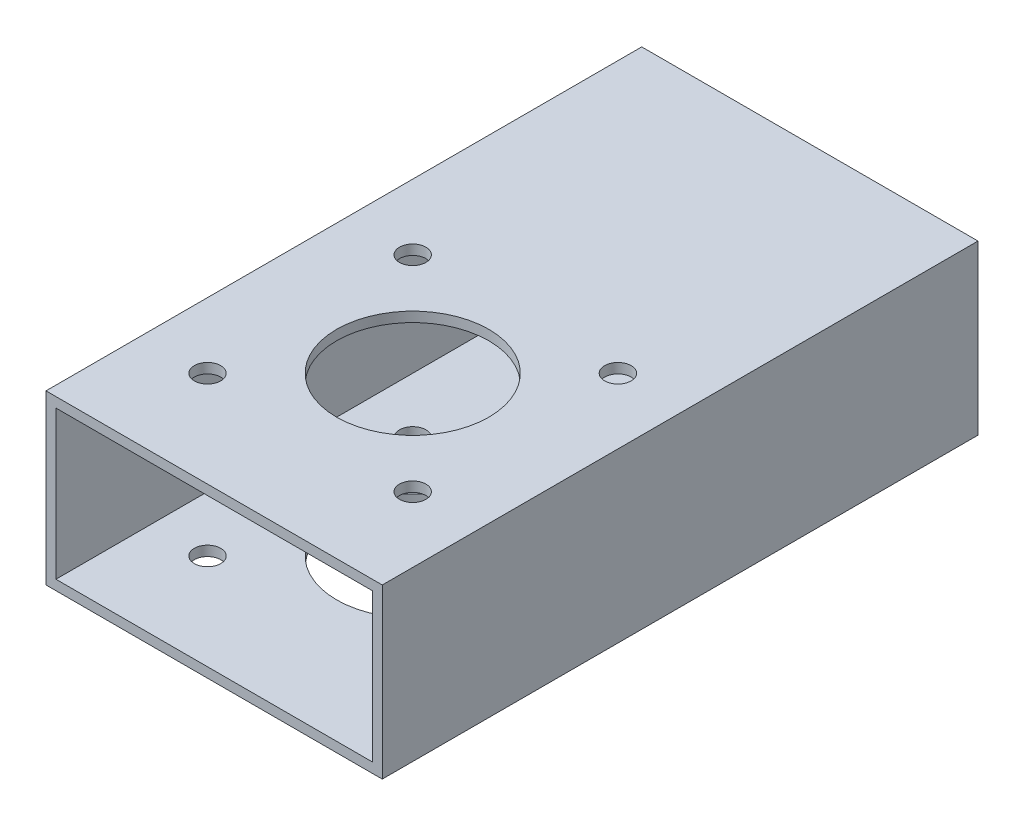
ISO-10303-21;
HEADER;
FILE_DESCRIPTION(('STEP AP214'),'2;1');
FILE_NAME('part.step','',(''),(''),'','','');
FILE_SCHEMA(('AUTOMOTIVE_DESIGN { 1 0 10303 214 1 1 1 1 }'));
ENDSEC;
DATA;
#1=APPLICATION_CONTEXT('core data for automotive mechanical design processes');
#2=APPLICATION_PROTOCOL_DEFINITION('international standard','automotive_design',2000,#1);
#3=PRODUCT_CONTEXT('',#1,'mechanical');
#4=PRODUCT('Part','Part','',(#3));
#5=PRODUCT_RELATED_PRODUCT_CATEGORY('part','',(#4));
#6=PRODUCT_DEFINITION_FORMATION('','',#4);
#7=PRODUCT_DEFINITION_CONTEXT('part definition',#1,'design');
#8=PRODUCT_DEFINITION('design','',#6,#7);
#9=PRODUCT_DEFINITION_SHAPE('','',#8);
#10=(LENGTH_UNIT() NAMED_UNIT(*) SI_UNIT(.MILLI.,.METRE.));
#11=(NAMED_UNIT(*) PLANE_ANGLE_UNIT() SI_UNIT($,.RADIAN.));
#12=(NAMED_UNIT(*) SI_UNIT($,.STERADIAN.) SOLID_ANGLE_UNIT());
#13=UNCERTAINTY_MEASURE_WITH_UNIT(LENGTH_MEASURE(1.E-05),#10,'distance_accuracy_value','');
#14=(GEOMETRIC_REPRESENTATION_CONTEXT(3) GLOBAL_UNCERTAINTY_ASSIGNED_CONTEXT((#13)) GLOBAL_UNIT_ASSIGNED_CONTEXT((#10,
#11,#12)) REPRESENTATION_CONTEXT('',''));
#15=CARTESIAN_POINT('',(0.,0.,0.));
#16=DIRECTION('',(0.,0.,1.));
#17=DIRECTION('',(1.,0.,0.));
#18=AXIS2_PLACEMENT_3D('',#15,#16,#17);
#19=CARTESIAN_POINT('',(0.,0.,90.));
#20=DIRECTION('',(0.,0.,-1.));
#21=DIRECTION('',(-1.,0.,0.));
#22=AXIS2_PLACEMENT_3D('',#19,#20,#21);
#23=PLANE('',#22);
#24=DIRECTION('',(0.,1.,0.));
#25=VECTOR('',#24,1.);
#26=CARTESIAN_POINT('',(25.3999999999999,-12.7,90.));
#27=LINE('',#26,#25);
#28=CARTESIAN_POINT('',(25.3999999999999,-12.7,90.));
#29=VERTEX_POINT('',#28);
#30=CARTESIAN_POINT('',(25.4,12.7,90.));
#31=VERTEX_POINT('',#30);
#32=EDGE_CURVE('E141',#29,#31,#27,.T.);
#33=ORIENTED_EDGE('',*,*,#32,.T.);
#34=DIRECTION('',(-1.,0.,0.));
#35=VECTOR('',#34,1.);
#36=CARTESIAN_POINT('',(-25.4,12.6999999999999,90.));
#37=LINE('',#36,#35);
#38=CARTESIAN_POINT('',(-25.4,12.6999999999999,90.));
#39=VERTEX_POINT('',#38);
#40=EDGE_CURVE('E144',#31,#39,#37,.T.);
#41=ORIENTED_EDGE('',*,*,#40,.T.);
#42=DIRECTION('',(0.,-1.,0.));
#43=VECTOR('',#42,1.);
#44=CARTESIAN_POINT('',(-25.4000000000001,-12.7000000000002,90.));
#45=LINE('',#44,#43);
#46=CARTESIAN_POINT('',(-25.4000000000001,-12.7000000000002,90.));
#47=VERTEX_POINT('',#46);
#48=EDGE_CURVE('E147',#39,#47,#45,.T.);
#49=ORIENTED_EDGE('',*,*,#48,.T.);
#50=DIRECTION('',(1.,0.,0.));
#51=VECTOR('',#50,1.);
#52=CARTESIAN_POINT('',(-25.4000000000001,-12.7000000000002,90.));
#53=LINE('',#52,#51);
#54=EDGE_CURVE('E149',#47,#29,#53,.T.);
#55=ORIENTED_EDGE('',*,*,#54,.T.);
#56=EDGE_LOOP('',(#33,#41,#49,#55));
#57=FACE_BOUND('',#56,.T.);
#58=DIRECTION('',(0.,-1.,0.));
#59=VECTOR('',#58,1.);
#60=CARTESIAN_POINT('',(-23.9000000000001,-11.2,90.));
#61=LINE('',#60,#59);
#62=CARTESIAN_POINT('',(-23.9,11.2,90.));
#63=VERTEX_POINT('',#62);
#64=CARTESIAN_POINT('',(-23.9000000000001,-11.2,90.));
#65=VERTEX_POINT('',#64);
#66=EDGE_CURVE('E103',#63,#65,#61,.T.);
#67=ORIENTED_EDGE('',*,*,#66,.F.);
#68=DIRECTION('',(-1.,0.,0.));
#69=VECTOR('',#68,1.);
#70=CARTESIAN_POINT('',(-23.9,11.2,90.));
#71=LINE('',#70,#69);
#72=CARTESIAN_POINT('',(23.9,11.2,90.));
#73=VERTEX_POINT('',#72);
#74=EDGE_CURVE('E125',#73,#63,#71,.T.);
#75=ORIENTED_EDGE('',*,*,#74,.F.);
#76=DIRECTION('',(0.,1.,0.));
#77=VECTOR('',#76,1.);
#78=CARTESIAN_POINT('',(23.8999999999999,-11.2,90.));
#79=LINE('',#78,#77);
#80=CARTESIAN_POINT('',(23.8999999999999,-11.2,90.));
#81=VERTEX_POINT('',#80);
#82=EDGE_CURVE('E123',#81,#73,#79,.T.);
#83=ORIENTED_EDGE('',*,*,#82,.F.);
#84=DIRECTION('',(1.,0.,0.));
#85=VECTOR('',#84,1.);
#86=CARTESIAN_POINT('',(-23.9000000000001,-11.2,90.));
#87=LINE('',#86,#85);
#88=EDGE_CURVE('E111',#65,#81,#87,.T.);
#89=ORIENTED_EDGE('',*,*,#88,.F.);
#90=EDGE_LOOP('',(#67,#75,#83,#89));
#91=FACE_BOUND('',#90,.T.);
#92=ADVANCED_FACE('F36',(#57,#91),#23,.F.);
#93=CARTESIAN_POINT('',(0.,0.,0.));
#94=DIRECTION('',(0.,0.,-1.));
#95=DIRECTION('',(-1.,0.,0.));
#96=AXIS2_PLACEMENT_3D('',#93,#94,#95);
#97=PLANE('',#96);
#98=DIRECTION('',(0.,1.,0.));
#99=VECTOR('',#98,1.);
#100=CARTESIAN_POINT('',(25.3999999999999,-12.7000000000002,0.));
#101=LINE('',#100,#99);
#102=CARTESIAN_POINT('',(25.3999999999999,-12.7000000000002,0.));
#103=VERTEX_POINT('',#102);
#104=CARTESIAN_POINT('',(25.4,12.6999999999998,0.));
#105=VERTEX_POINT('',#104);
#106=EDGE_CURVE('E119',#103,#105,#101,.T.);
#107=ORIENTED_EDGE('',*,*,#106,.F.);
#108=DIRECTION('',(1.,0.,0.));
#109=VECTOR('',#108,1.);
#110=CARTESIAN_POINT('',(-25.4000000000001,-12.7,0.));
#111=LINE('',#110,#109);
#112=CARTESIAN_POINT('',(-25.4000000000001,-12.7,0.));
#113=VERTEX_POINT('',#112);
#114=EDGE_CURVE('E145',#113,#103,#111,.T.);
#115=ORIENTED_EDGE('',*,*,#114,.F.);
#116=DIRECTION('',(0.,-1.,0.));
#117=VECTOR('',#116,1.);
#118=CARTESIAN_POINT('',(-25.4000000000001,-12.7,0.));
#119=LINE('',#118,#117);
#120=CARTESIAN_POINT('',(-25.4,12.7,0.));
#121=VERTEX_POINT('',#120);
#122=EDGE_CURVE('E156',#121,#113,#119,.T.);
#123=ORIENTED_EDGE('',*,*,#122,.F.);
#124=DIRECTION('',(-1.,0.,0.));
#125=VECTOR('',#124,1.);
#126=CARTESIAN_POINT('',(-25.4,12.7,0.));
#127=LINE('',#126,#125);
#128=EDGE_CURVE('E154',#105,#121,#127,.T.);
#129=ORIENTED_EDGE('',*,*,#128,.F.);
#130=EDGE_LOOP('',(#107,#115,#123,#129));
#131=FACE_BOUND('',#130,.T.);
#132=DIRECTION('',(-1.,0.,0.));
#133=VECTOR('',#132,1.);
#134=CARTESIAN_POINT('',(-23.9,11.2,0.));
#135=LINE('',#134,#133);
#136=CARTESIAN_POINT('',(23.9,11.1999999999998,0.));
#137=VERTEX_POINT('',#136);
#138=CARTESIAN_POINT('',(-23.9,11.2,0.));
#139=VERTEX_POINT('',#138);
#140=EDGE_CURVE('E112',#137,#139,#135,.T.);
#141=ORIENTED_EDGE('',*,*,#140,.T.);
#142=DIRECTION('',(0.,-1.,0.));
#143=VECTOR('',#142,1.);
#144=CARTESIAN_POINT('',(-23.9000000000001,-11.2,0.));
#145=LINE('',#144,#143);
#146=CARTESIAN_POINT('',(-23.9000000000001,-11.2,0.));
#147=VERTEX_POINT('',#146);
#148=EDGE_CURVE('E61',#139,#147,#145,.T.);
#149=ORIENTED_EDGE('',*,*,#148,.T.);
#150=DIRECTION('',(1.,0.,0.));
#151=VECTOR('',#150,1.);
#152=CARTESIAN_POINT('',(-23.9000000000001,-11.2,0.));
#153=LINE('',#152,#151);
#154=CARTESIAN_POINT('',(23.8999999999999,-11.2000000000002,0.));
#155=VERTEX_POINT('',#154);
#156=EDGE_CURVE('E118',#147,#155,#153,.T.);
#157=ORIENTED_EDGE('',*,*,#156,.T.);
#158=DIRECTION('',(0.,1.,0.));
#159=VECTOR('',#158,1.);
#160=CARTESIAN_POINT('',(23.8999999999999,-11.2000000000002,0.));
#161=LINE('',#160,#159);
#162=EDGE_CURVE('E133',#155,#137,#161,.T.);
#163=ORIENTED_EDGE('',*,*,#162,.T.);
#164=EDGE_LOOP('',(#141,#149,#157,#163));
#165=FACE_BOUND('',#164,.T.);
#166=ADVANCED_FACE('F241',(#131,#165),#97,.T.);
#167=CARTESIAN_POINT('',(25.3999999999999,-12.7,90.));
#168=DIRECTION('',(-1.,0.,0.));
#169=DIRECTION('',(0.,0.,1.));
#170=AXIS2_PLACEMENT_3D('',#167,#168,#169);
#171=PLANE('',#170);
#172=ORIENTED_EDGE('',*,*,#106,.T.);
#173=DIRECTION('',(0.,0.,-1.));
#174=VECTOR('',#173,1.);
#175=CARTESIAN_POINT('',(25.4,12.7,90.));
#176=LINE('',#175,#174);
#177=EDGE_CURVE('E11',#31,#105,#176,.T.);
#178=ORIENTED_EDGE('',*,*,#177,.F.);
#179=ORIENTED_EDGE('',*,*,#32,.F.);
#180=DIRECTION('',(0.,0.,-1.));
#181=VECTOR('',#180,1.);
#182=CARTESIAN_POINT('',(25.3999999999999,-12.7,90.));
#183=LINE('',#182,#181);
#184=EDGE_CURVE('E151',#29,#103,#183,.T.);
#185=ORIENTED_EDGE('',*,*,#184,.T.);
#186=EDGE_LOOP('',(#172,#178,#179,#185));
#187=FACE_BOUND('',#186,.T.);
#188=ADVANCED_FACE('F38',(#187),#171,.F.);
#189=CARTESIAN_POINT('',(-25.4,12.6999999999999,90.));
#190=DIRECTION('',(0.,-1.,0.));
#191=DIRECTION('',(0.,0.,-1.));
#192=AXIS2_PLACEMENT_3D('',#189,#190,#191);
#193=PLANE('',#192);
#194=CARTESIAN_POINT('',(-15.5,12.7,44.5));
#195=DIRECTION('',(0.,-1.,0.));
#196=DIRECTION('',(0.,0.,-1.));
#197=AXIS2_PLACEMENT_3D('',#194,#195,#196);
#198=CIRCLE('',#197,2.);
#199=CARTESIAN_POINT('',(-15.5,12.7,42.5));
#200=VERTEX_POINT('',#199);
#201=EDGE_CURVE('E190',#200,#200,#198,.T.);
#202=ORIENTED_EDGE('',*,*,#201,.T.);
#203=EDGE_LOOP('',(#202));
#204=FACE_BOUND('',#203,.T.);
#205=CARTESIAN_POINT('',(15.5,12.7,44.5));
#206=DIRECTION('',(0.,-1.,0.));
#207=DIRECTION('',(0.,0.,-1.));
#208=AXIS2_PLACEMENT_3D('',#205,#206,#207);
#209=CIRCLE('',#208,2.);
#210=CARTESIAN_POINT('',(15.5,12.7,42.5));
#211=VERTEX_POINT('',#210);
#212=EDGE_CURVE('E187',#211,#211,#209,.T.);
#213=ORIENTED_EDGE('',*,*,#212,.T.);
#214=EDGE_LOOP('',(#213));
#215=FACE_BOUND('',#214,.T.);
#216=CARTESIAN_POINT('',(15.5,12.6999999999998,75.5));
#217=DIRECTION('',(0.,-1.,0.));
#218=DIRECTION('',(0.,0.,-1.));
#219=AXIS2_PLACEMENT_3D('',#216,#217,#218);
#220=CIRCLE('',#219,2.);
#221=CARTESIAN_POINT('',(15.5,12.6999999999998,73.5));
#222=VERTEX_POINT('',#221);
#223=EDGE_CURVE('E205',#222,#222,#220,.T.);
#224=ORIENTED_EDGE('',*,*,#223,.T.);
#225=EDGE_LOOP('',(#224));
#226=FACE_BOUND('',#225,.T.);
#227=CARTESIAN_POINT('',(-15.5,12.7,75.5));
#228=DIRECTION('',(0.,-1.,0.));
#229=DIRECTION('',(0.,0.,-1.));
#230=AXIS2_PLACEMENT_3D('',#227,#228,#229);
#231=CIRCLE('',#230,2.);
#232=CARTESIAN_POINT('',(-15.5,12.7,73.5));
#233=VERTEX_POINT('',#232);
#234=EDGE_CURVE('E212',#233,#233,#231,.T.);
#235=ORIENTED_EDGE('',*,*,#234,.T.);
#236=EDGE_LOOP('',(#235));
#237=FACE_BOUND('',#236,.T.);
#238=CARTESIAN_POINT('',(0.,12.6999999999999,60.));
#239=DIRECTION('',(0.,-1.,0.));
#240=DIRECTION('',(0.,0.,-1.));
#241=AXIS2_PLACEMENT_3D('',#238,#239,#240);
#242=CIRCLE('',#241,11.5);
#243=CARTESIAN_POINT('',(0.,12.6999999999999,48.5));
#244=VERTEX_POINT('',#243);
#245=EDGE_CURVE('E131',#244,#244,#242,.T.);
#246=ORIENTED_EDGE('',*,*,#245,.T.);
#247=EDGE_LOOP('',(#246));
#248=FACE_BOUND('',#247,.T.);
#249=ORIENTED_EDGE('',*,*,#128,.T.);
#250=DIRECTION('',(0.,0.,-1.));
#251=VECTOR('',#250,1.);
#252=CARTESIAN_POINT('',(-25.4,12.6999999999999,90.));
#253=LINE('',#252,#251);
#254=EDGE_CURVE('E45',#39,#121,#253,.T.);
#255=ORIENTED_EDGE('',*,*,#254,.F.);
#256=ORIENTED_EDGE('',*,*,#40,.F.);
#257=ORIENTED_EDGE('',*,*,#177,.T.);
#258=EDGE_LOOP('',(#249,#255,#256,#257));
#259=FACE_BOUND('',#258,.T.);
#260=ADVANCED_FACE('F221',(#204,#215,#226,#237,#248,#259),#193,.F.);
#261=CARTESIAN_POINT('',(-25.4000000000001,-12.7000000000002,90.));
#262=DIRECTION('',(1.,0.,0.));
#263=DIRECTION('',(0.,0.,-1.));
#264=AXIS2_PLACEMENT_3D('',#261,#262,#263);
#265=PLANE('',#264);
#266=ORIENTED_EDGE('',*,*,#122,.T.);
#267=DIRECTION('',(0.,0.,-1.));
#268=VECTOR('',#267,1.);
#269=CARTESIAN_POINT('',(-25.4000000000001,-12.7000000000002,90.));
#270=LINE('',#269,#268);
#271=EDGE_CURVE('E161',#47,#113,#270,.T.);
#272=ORIENTED_EDGE('',*,*,#271,.F.);
#273=ORIENTED_EDGE('',*,*,#48,.F.);
#274=ORIENTED_EDGE('',*,*,#254,.T.);
#275=EDGE_LOOP('',(#266,#272,#273,#274));
#276=FACE_BOUND('',#275,.T.);
#277=ADVANCED_FACE('F255',(#276),#265,.F.);
#278=CARTESIAN_POINT('',(-25.4000000000001,-12.7000000000002,90.));
#279=DIRECTION('',(0.,1.,0.));
#280=DIRECTION('',(0.,0.,1.));
#281=AXIS2_PLACEMENT_3D('',#278,#279,#280);
#282=PLANE('',#281);
#283=CARTESIAN_POINT('',(-15.5000000000001,-12.7,44.5));
#284=DIRECTION('',(0.,-1.,0.));
#285=DIRECTION('',(0.,0.,1.));
#286=AXIS2_PLACEMENT_3D('',#283,#284,#285);
#287=CIRCLE('',#286,2.);
#288=CARTESIAN_POINT('',(-15.5000000000001,-12.7,46.5));
#289=VERTEX_POINT('',#288);
#290=EDGE_CURVE('E303',#289,#289,#287,.T.);
#291=ORIENTED_EDGE('',*,*,#290,.F.);
#292=EDGE_LOOP('',(#291));
#293=FACE_BOUND('',#292,.T.);
#294=CARTESIAN_POINT('',(15.4999999999999,-12.7,44.5));
#295=DIRECTION('',(0.,-1.,0.));
#296=DIRECTION('',(0.,0.,-1.));
#297=AXIS2_PLACEMENT_3D('',#294,#295,#296);
#298=CIRCLE('',#297,2.);
#299=CARTESIAN_POINT('',(15.4999999999999,-12.7,42.5));
#300=VERTEX_POINT('',#299);
#301=EDGE_CURVE('E183',#300,#300,#298,.T.);
#302=ORIENTED_EDGE('',*,*,#301,.F.);
#303=EDGE_LOOP('',(#302));
#304=FACE_BOUND('',#303,.T.);
#305=CARTESIAN_POINT('',(15.4999999999999,-12.7000000000002,75.5));
#306=DIRECTION('',(0.,-1.,0.));
#307=DIRECTION('',(0.,0.,1.));
#308=AXIS2_PLACEMENT_3D('',#305,#306,#307);
#309=CIRCLE('',#308,2.);
#310=CARTESIAN_POINT('',(15.4999999999999,-12.7000000000002,77.5));
#311=VERTEX_POINT('',#310);
#312=EDGE_CURVE('E179',#311,#311,#309,.T.);
#313=ORIENTED_EDGE('',*,*,#312,.F.);
#314=EDGE_LOOP('',(#313));
#315=FACE_BOUND('',#314,.T.);
#316=CARTESIAN_POINT('',(-15.5000000000001,-12.7,75.5));
#317=DIRECTION('',(0.,-1.,0.));
#318=DIRECTION('',(0.,0.,-1.));
#319=AXIS2_PLACEMENT_3D('',#316,#317,#318);
#320=CIRCLE('',#319,2.);
#321=CARTESIAN_POINT('',(-15.5000000000001,-12.7,73.5));
#322=VERTEX_POINT('',#321);
#323=EDGE_CURVE('E175',#322,#322,#320,.T.);
#324=ORIENTED_EDGE('',*,*,#323,.F.);
#325=EDGE_LOOP('',(#324));
#326=FACE_BOUND('',#325,.T.);
#327=CARTESIAN_POINT('',(-1.11022302462516E-13,-12.7000000000002,60.));
#328=DIRECTION('',(0.,-1.,0.));
#329=DIRECTION('',(0.,0.,-1.));
#330=AXIS2_PLACEMENT_3D('',#327,#328,#329);
#331=CIRCLE('',#330,11.5);
#332=CARTESIAN_POINT('',(-1.11022302462511E-13,-12.7000000000002,48.5));
#333=VERTEX_POINT('',#332);
#334=EDGE_CURVE('E170',#333,#333,#331,.T.);
#335=ORIENTED_EDGE('',*,*,#334,.F.);
#336=EDGE_LOOP('',(#335));
#337=FACE_BOUND('',#336,.T.);
#338=ORIENTED_EDGE('',*,*,#114,.T.);
#339=ORIENTED_EDGE('',*,*,#184,.F.);
#340=ORIENTED_EDGE('',*,*,#54,.F.);
#341=ORIENTED_EDGE('',*,*,#271,.T.);
#342=EDGE_LOOP('',(#338,#339,#340,#341));
#343=FACE_BOUND('',#342,.T.);
#344=ADVANCED_FACE('F252',(#293,#304,#315,#326,#337,#343),#282,.F.);
#345=CARTESIAN_POINT('',(-23.9000000000001,-11.2,90.));
#346=DIRECTION('',(1.,0.,0.));
#347=DIRECTION('',(0.,0.,-1.));
#348=AXIS2_PLACEMENT_3D('',#345,#346,#347);
#349=PLANE('',#348);
#350=ORIENTED_EDGE('',*,*,#148,.F.);
#351=DIRECTION('',(0.,0.,-1.));
#352=VECTOR('',#351,1.);
#353=CARTESIAN_POINT('',(-23.9,11.2,90.));
#354=LINE('',#353,#352);
#355=EDGE_CURVE('E107',#63,#139,#354,.T.);
#356=ORIENTED_EDGE('',*,*,#355,.F.);
#357=ORIENTED_EDGE('',*,*,#66,.T.);
#358=DIRECTION('',(0.,0.,-1.));
#359=VECTOR('',#358,1.);
#360=CARTESIAN_POINT('',(-23.9000000000001,-11.2,90.));
#361=LINE('',#360,#359);
#362=EDGE_CURVE('E106',#65,#147,#361,.T.);
#363=ORIENTED_EDGE('',*,*,#362,.T.);
#364=EDGE_LOOP('',(#350,#356,#357,#363));
#365=FACE_BOUND('',#364,.T.);
#366=ADVANCED_FACE('F105',(#365),#349,.T.);
#367=CARTESIAN_POINT('',(-23.9000000000001,-11.2,90.));
#368=DIRECTION('',(0.,1.,0.));
#369=DIRECTION('',(0.,0.,1.));
#370=AXIS2_PLACEMENT_3D('',#367,#368,#369);
#371=PLANE('',#370);
#372=CARTESIAN_POINT('',(-15.5000000000001,-11.2,44.5));
#373=DIRECTION('',(0.,1.,0.));
#374=DIRECTION('',(0.,0.,1.));
#375=AXIS2_PLACEMENT_3D('',#372,#373,#374);
#376=CIRCLE('',#375,2.);
#377=CARTESIAN_POINT('',(-15.5000000000001,-11.2,46.5));
#378=VERTEX_POINT('',#377);
#379=EDGE_CURVE('E195',#378,#378,#376,.T.);
#380=ORIENTED_EDGE('',*,*,#379,.F.);
#381=EDGE_LOOP('',(#380));
#382=FACE_BOUND('',#381,.T.);
#383=CARTESIAN_POINT('',(15.4999999999999,-11.2,44.5));
#384=DIRECTION('',(0.,1.,0.));
#385=DIRECTION('',(0.,0.,1.));
#386=AXIS2_PLACEMENT_3D('',#383,#384,#385);
#387=CIRCLE('',#386,2.);
#388=CARTESIAN_POINT('',(15.4999999999999,-11.2,46.5));
#389=VERTEX_POINT('',#388);
#390=EDGE_CURVE('E182',#389,#389,#387,.T.);
#391=ORIENTED_EDGE('',*,*,#390,.F.);
#392=EDGE_LOOP('',(#391));
#393=FACE_BOUND('',#392,.T.);
#394=CARTESIAN_POINT('',(15.4999999999999,-11.2000000000002,75.5));
#395=DIRECTION('',(0.,1.,0.));
#396=DIRECTION('',(0.,0.,1.));
#397=AXIS2_PLACEMENT_3D('',#394,#395,#396);
#398=CIRCLE('',#397,2.);
#399=CARTESIAN_POINT('',(15.4999999999999,-11.2000000000002,77.5));
#400=VERTEX_POINT('',#399);
#401=EDGE_CURVE('E178',#400,#400,#398,.T.);
#402=ORIENTED_EDGE('',*,*,#401,.F.);
#403=EDGE_LOOP('',(#402));
#404=FACE_BOUND('',#403,.T.);
#405=CARTESIAN_POINT('',(-15.5000000000001,-11.2,75.5));
#406=DIRECTION('',(0.,1.,0.));
#407=DIRECTION('',(0.,0.,1.));
#408=AXIS2_PLACEMENT_3D('',#405,#406,#407);
#409=CIRCLE('',#408,2.);
#410=CARTESIAN_POINT('',(-15.5000000000001,-11.2,77.5));
#411=VERTEX_POINT('',#410);
#412=EDGE_CURVE('E174',#411,#411,#409,.T.);
#413=ORIENTED_EDGE('',*,*,#412,.F.);
#414=EDGE_LOOP('',(#413));
#415=FACE_BOUND('',#414,.T.);
#416=CARTESIAN_POINT('',(-1.11022302462516E-13,-11.2000000000002,60.));
#417=DIRECTION('',(0.,1.,0.));
#418=DIRECTION('',(0.,0.,1.));
#419=AXIS2_PLACEMENT_3D('',#416,#417,#418);
#420=CIRCLE('',#419,11.5);
#421=CARTESIAN_POINT('',(-1.1102230246252E-13,-11.2000000000002,71.5));
#422=VERTEX_POINT('',#421);
#423=EDGE_CURVE('E169',#422,#422,#420,.T.);
#424=ORIENTED_EDGE('',*,*,#423,.F.);
#425=EDGE_LOOP('',(#424));
#426=FACE_BOUND('',#425,.T.);
#427=ORIENTED_EDGE('',*,*,#156,.F.);
#428=ORIENTED_EDGE('',*,*,#362,.F.);
#429=ORIENTED_EDGE('',*,*,#88,.T.);
#430=DIRECTION('',(0.,0.,-1.));
#431=VECTOR('',#430,1.);
#432=CARTESIAN_POINT('',(23.8999999999999,-11.2,90.));
#433=LINE('',#432,#431);
#434=EDGE_CURVE('E120',#81,#155,#433,.T.);
#435=ORIENTED_EDGE('',*,*,#434,.T.);
#436=EDGE_LOOP('',(#427,#428,#429,#435));
#437=FACE_BOUND('',#436,.T.);
#438=ADVANCED_FACE('F115',(#382,#393,#404,#415,#426,#437),#371,.T.);
#439=CARTESIAN_POINT('',(23.8999999999999,-11.2,90.));
#440=DIRECTION('',(-1.,0.,0.));
#441=DIRECTION('',(0.,0.,1.));
#442=AXIS2_PLACEMENT_3D('',#439,#440,#441);
#443=PLANE('',#442);
#444=ORIENTED_EDGE('',*,*,#162,.F.);
#445=ORIENTED_EDGE('',*,*,#434,.F.);
#446=ORIENTED_EDGE('',*,*,#82,.T.);
#447=DIRECTION('',(0.,0.,-1.));
#448=VECTOR('',#447,1.);
#449=CARTESIAN_POINT('',(23.9,11.2,90.));
#450=LINE('',#449,#448);
#451=EDGE_CURVE('E53',#73,#137,#450,.T.);
#452=ORIENTED_EDGE('',*,*,#451,.T.);
#453=EDGE_LOOP('',(#444,#445,#446,#452));
#454=FACE_BOUND('',#453,.T.);
#455=ADVANCED_FACE('F236',(#454),#443,.T.);
#456=CARTESIAN_POINT('',(-23.9,11.2,90.));
#457=DIRECTION('',(0.,-1.,0.));
#458=DIRECTION('',(1.,0.,0.));
#459=AXIS2_PLACEMENT_3D('',#456,#457,#458);
#460=PLANE('',#459);
#461=CARTESIAN_POINT('',(-15.5,11.2,44.5));
#462=DIRECTION('',(0.,-1.,0.));
#463=DIRECTION('',(1.,0.,0.));
#464=AXIS2_PLACEMENT_3D('',#461,#462,#463);
#465=CIRCLE('',#464,2.);
#466=CARTESIAN_POINT('',(-13.5,11.2,44.5));
#467=VERTEX_POINT('',#466);
#468=EDGE_CURVE('E40',#467,#467,#465,.T.);
#469=ORIENTED_EDGE('',*,*,#468,.F.);
#470=EDGE_LOOP('',(#469));
#471=FACE_BOUND('',#470,.T.);
#472=CARTESIAN_POINT('',(15.5,11.2,44.5));
#473=DIRECTION('',(0.,-1.,0.));
#474=DIRECTION('',(1.,0.,0.));
#475=AXIS2_PLACEMENT_3D('',#472,#473,#474);
#476=CIRCLE('',#475,2.);
#477=CARTESIAN_POINT('',(17.5,11.2,44.5));
#478=VERTEX_POINT('',#477);
#479=EDGE_CURVE('E180',#478,#478,#476,.T.);
#480=ORIENTED_EDGE('',*,*,#479,.F.);
#481=EDGE_LOOP('',(#480));
#482=FACE_BOUND('',#481,.T.);
#483=CARTESIAN_POINT('',(15.5,11.1999999999998,75.5));
#484=DIRECTION('',(0.,-1.,0.));
#485=DIRECTION('',(1.,0.,0.));
#486=AXIS2_PLACEMENT_3D('',#483,#484,#485);
#487=CIRCLE('',#486,2.);
#488=CARTESIAN_POINT('',(17.5,11.1999999999998,75.5));
#489=VERTEX_POINT('',#488);
#490=EDGE_CURVE('E176',#489,#489,#487,.T.);
#491=ORIENTED_EDGE('',*,*,#490,.F.);
#492=EDGE_LOOP('',(#491));
#493=FACE_BOUND('',#492,.T.);
#494=CARTESIAN_POINT('',(-15.5,11.2,75.5));
#495=DIRECTION('',(0.,-1.,0.));
#496=DIRECTION('',(1.,0.,0.));
#497=AXIS2_PLACEMENT_3D('',#494,#495,#496);
#498=CIRCLE('',#497,2.);
#499=CARTESIAN_POINT('',(-13.5,11.2,75.5));
#500=VERTEX_POINT('',#499);
#501=EDGE_CURVE('E171',#500,#500,#498,.T.);
#502=ORIENTED_EDGE('',*,*,#501,.F.);
#503=EDGE_LOOP('',(#502));
#504=FACE_BOUND('',#503,.T.);
#505=CARTESIAN_POINT('',(0.,11.1999999999999,60.));
#506=DIRECTION('',(0.,-1.,0.));
#507=DIRECTION('',(1.,0.,0.));
#508=AXIS2_PLACEMENT_3D('',#505,#506,#507);
#509=CIRCLE('',#508,11.5);
#510=CARTESIAN_POINT('',(11.5,11.1999999999999,60.));
#511=VERTEX_POINT('',#510);
#512=EDGE_CURVE('E166',#511,#511,#509,.T.);
#513=ORIENTED_EDGE('',*,*,#512,.F.);
#514=EDGE_LOOP('',(#513));
#515=FACE_BOUND('',#514,.T.);
#516=ORIENTED_EDGE('',*,*,#140,.F.);
#517=ORIENTED_EDGE('',*,*,#451,.F.);
#518=ORIENTED_EDGE('',*,*,#74,.T.);
#519=ORIENTED_EDGE('',*,*,#355,.T.);
#520=EDGE_LOOP('',(#516,#517,#518,#519));
#521=FACE_BOUND('',#520,.T.);
#522=ADVANCED_FACE('F227',(#471,#482,#493,#504,#515,#521),#460,.T.);
#523=CARTESIAN_POINT('',(0.,13.2999999999999,60.));
#524=DIRECTION('',(0.,-1.,0.));
#525=DIRECTION('',(0.,0.,-1.));
#526=AXIS2_PLACEMENT_3D('',#523,#524,#525);
#527=CYLINDRICAL_SURFACE('',#526,11.5);
#528=ORIENTED_EDGE('',*,*,#512,.T.);
#529=EDGE_LOOP('',(#528));
#530=FACE_BOUND('',#529,.T.);
#531=ORIENTED_EDGE('',*,*,#245,.F.);
#532=EDGE_LOOP('',(#531));
#533=FACE_BOUND('',#532,.T.);
#534=ADVANCED_FACE('F224',(#530,#533),#527,.F.);
#535=ORIENTED_EDGE('',*,*,#423,.T.);
#536=EDGE_LOOP('',(#535));
#537=FACE_BOUND('',#536,.T.);
#538=ORIENTED_EDGE('',*,*,#334,.T.);
#539=EDGE_LOOP('',(#538));
#540=FACE_BOUND('',#539,.T.);
#541=ADVANCED_FACE('F226',(#537,#540),#527,.F.);
#542=CARTESIAN_POINT('',(-15.5,13.3,75.5));
#543=DIRECTION('',(0.,-1.,0.));
#544=DIRECTION('',(0.,0.,-1.));
#545=AXIS2_PLACEMENT_3D('',#542,#543,#544);
#546=CYLINDRICAL_SURFACE('',#545,2.);
#547=ORIENTED_EDGE('',*,*,#501,.T.);
#548=EDGE_LOOP('',(#547));
#549=FACE_BOUND('',#548,.T.);
#550=ORIENTED_EDGE('',*,*,#234,.F.);
#551=EDGE_LOOP('',(#550));
#552=FACE_BOUND('',#551,.T.);
#553=ADVANCED_FACE('F234',(#549,#552),#546,.F.);
#554=ORIENTED_EDGE('',*,*,#412,.T.);
#555=EDGE_LOOP('',(#554));
#556=FACE_BOUND('',#555,.T.);
#557=ORIENTED_EDGE('',*,*,#323,.T.);
#558=EDGE_LOOP('',(#557));
#559=FACE_BOUND('',#558,.T.);
#560=ADVANCED_FACE('F274',(#556,#559),#546,.F.);
#561=CARTESIAN_POINT('',(15.5,13.2999999999999,75.5));
#562=DIRECTION('',(0.,-1.,0.));
#563=DIRECTION('',(0.,0.,-1.));
#564=AXIS2_PLACEMENT_3D('',#561,#562,#563);
#565=CYLINDRICAL_SURFACE('',#564,2.);
#566=ORIENTED_EDGE('',*,*,#490,.T.);
#567=EDGE_LOOP('',(#566));
#568=FACE_BOUND('',#567,.T.);
#569=ORIENTED_EDGE('',*,*,#223,.F.);
#570=EDGE_LOOP('',(#569));
#571=FACE_BOUND('',#570,.T.);
#572=ADVANCED_FACE('F279',(#568,#571),#565,.F.);
#573=ORIENTED_EDGE('',*,*,#401,.T.);
#574=EDGE_LOOP('',(#573));
#575=FACE_BOUND('',#574,.T.);
#576=ORIENTED_EDGE('',*,*,#312,.T.);
#577=EDGE_LOOP('',(#576));
#578=FACE_BOUND('',#577,.T.);
#579=ADVANCED_FACE('F284',(#575,#578),#565,.F.);
#580=CARTESIAN_POINT('',(15.5,13.3,44.5));
#581=DIRECTION('',(0.,-1.,0.));
#582=DIRECTION('',(0.,0.,-1.));
#583=AXIS2_PLACEMENT_3D('',#580,#581,#582);
#584=CYLINDRICAL_SURFACE('',#583,2.);
#585=ORIENTED_EDGE('',*,*,#479,.T.);
#586=EDGE_LOOP('',(#585));
#587=FACE_BOUND('',#586,.T.);
#588=ORIENTED_EDGE('',*,*,#212,.F.);
#589=EDGE_LOOP('',(#588));
#590=FACE_BOUND('',#589,.T.);
#591=ADVANCED_FACE('F286',(#587,#590),#584,.F.);
#592=ORIENTED_EDGE('',*,*,#390,.T.);
#593=EDGE_LOOP('',(#592));
#594=FACE_BOUND('',#593,.T.);
#595=ORIENTED_EDGE('',*,*,#301,.T.);
#596=EDGE_LOOP('',(#595));
#597=FACE_BOUND('',#596,.T.);
#598=ADVANCED_FACE('F289',(#594,#597),#584,.F.);
#599=CARTESIAN_POINT('',(-15.5,13.3,44.5));
#600=DIRECTION('',(0.,-1.,0.));
#601=DIRECTION('',(0.,0.,-1.));
#602=AXIS2_PLACEMENT_3D('',#599,#600,#601);
#603=CYLINDRICAL_SURFACE('',#602,2.);
#604=ORIENTED_EDGE('',*,*,#468,.T.);
#605=EDGE_LOOP('',(#604));
#606=FACE_BOUND('',#605,.T.);
#607=ORIENTED_EDGE('',*,*,#201,.F.);
#608=EDGE_LOOP('',(#607));
#609=FACE_BOUND('',#608,.T.);
#610=ADVANCED_FACE('F290',(#606,#609),#603,.F.);
#611=ORIENTED_EDGE('',*,*,#379,.T.);
#612=EDGE_LOOP('',(#611));
#613=FACE_BOUND('',#612,.T.);
#614=ORIENTED_EDGE('',*,*,#290,.T.);
#615=EDGE_LOOP('',(#614));
#616=FACE_BOUND('',#615,.T.);
#617=ADVANCED_FACE('F292',(#613,#616),#603,.F.);
#618=CLOSED_SHELL('',(#92,#166,#188,#260,#277,#344,#366,#438,#455,#522,#534,#541,#553,#560,#572,
#579,#591,#598,#610,#617));
#619=MANIFOLD_SOLID_BREP('B2',#618);
#620=ADVANCED_BREP_SHAPE_REPRESENTATION('',(#18,#619),#14);
#621=SHAPE_DEFINITION_REPRESENTATION(#9,#620);
ENDSEC;
END-ISO-10303-21;
